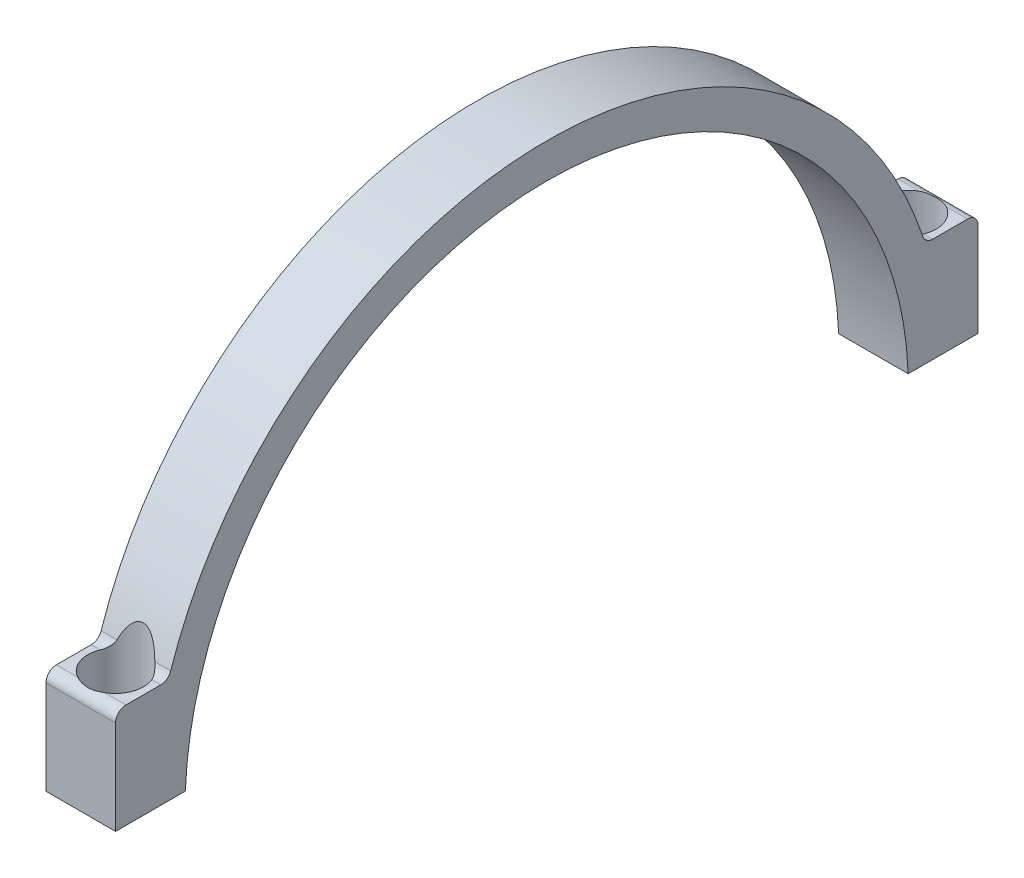
ISO-10303-21;
HEADER;
FILE_DESCRIPTION(('STEP AP214'),'2;1');
FILE_NAME('part.step','',(''),(''),'','','');
FILE_SCHEMA(('AUTOMOTIVE_DESIGN { 1 0 10303 214 1 1 1 1 }'));
ENDSEC;
DATA;
#1=APPLICATION_CONTEXT('core data for automotive mechanical design processes');
#2=APPLICATION_PROTOCOL_DEFINITION('international standard','automotive_design',2000,#1);
#3=PRODUCT_CONTEXT('',#1,'mechanical');
#4=PRODUCT('Part','Part','',(#3));
#5=PRODUCT_RELATED_PRODUCT_CATEGORY('part','',(#4));
#6=PRODUCT_DEFINITION_FORMATION('','',#4);
#7=PRODUCT_DEFINITION_CONTEXT('part definition',#1,'design');
#8=PRODUCT_DEFINITION('design','',#6,#7);
#9=PRODUCT_DEFINITION_SHAPE('','',#8);
#10=(LENGTH_UNIT() NAMED_UNIT(*) SI_UNIT(.MILLI.,.METRE.));
#11=(NAMED_UNIT(*) PLANE_ANGLE_UNIT() SI_UNIT($,.RADIAN.));
#12=(NAMED_UNIT(*) SI_UNIT($,.STERADIAN.) SOLID_ANGLE_UNIT());
#13=UNCERTAINTY_MEASURE_WITH_UNIT(LENGTH_MEASURE(1.E-05),#10,'distance_accuracy_value','');
#14=(GEOMETRIC_REPRESENTATION_CONTEXT(3) GLOBAL_UNCERTAINTY_ASSIGNED_CONTEXT((#13)) GLOBAL_UNIT_ASSIGNED_CONTEXT((#10,
#11,#12)) REPRESENTATION_CONTEXT('',''));
#15=CARTESIAN_POINT('',(0.,0.,0.));
#16=DIRECTION('',(0.,0.,1.));
#17=DIRECTION('',(1.,0.,0.));
#18=AXIS2_PLACEMENT_3D('',#15,#16,#17);
#19=CARTESIAN_POINT('',(10.,0.,0.));
#20=DIRECTION('',(-1.,0.,0.));
#21=DIRECTION('',(0.,0.,1.));
#22=AXIS2_PLACEMENT_3D('',#19,#20,#21);
#23=CYLINDRICAL_SURFACE('',#22,57.);
#24=CARTESIAN_POINT('',(8.04475811573962,16.9999999999999,54.4058820349418));
#25=CARTESIAN_POINT('',(8.02021668989877,17.0921756252909,54.3770804002913));
#26=CARTESIAN_POINT('',(7.99483062045849,17.1840716817121,54.34810867595));
#27=CARTESIAN_POINT('',(7.94221642335376,17.367247188698,54.2898513763058));
#28=CARTESIAN_POINT('',(7.91498807726504,17.4585265647317,54.2605657641353));
#29=CARTESIAN_POINT('',(7.83019634222226,17.7317172758495,54.1721595897697));
#30=CARTESIAN_POINT('',(7.76963197801326,17.9125785303137,54.1126155764916));
#31=CARTESIAN_POINT('',(7.63820795500454,18.2728715762059,53.9920245012619));
#32=CARTESIAN_POINT('',(7.56722818782228,18.4522566409079,53.9309679541037));
#33=CARTESIAN_POINT('',(7.41357596006679,18.8057769825377,53.8087133646927));
#34=CARTESIAN_POINT('',(7.33091515306761,18.9799172843484,53.7475155225443));
#35=CARTESIAN_POINT('',(7.19706963698908,19.2336862932719,53.6569955235999));
#36=CARTESIAN_POINT('',(7.15139505722209,19.3161230779365,53.6273706868382));
#37=CARTESIAN_POINT('',(7.05614950175837,19.4788701611248,53.5684711148856));
#38=CARTESIAN_POINT('',(7.00657809472277,19.5591802229231,53.5391964188661));
#39=CARTESIAN_POINT('',(6.90313383675338,19.7170697184556,53.4812511159975));
#40=CARTESIAN_POINT('',(6.8492664363487,19.7946524378573,53.4525798002264));
#41=CARTESIAN_POINT('',(6.73663764221897,19.9464887178001,53.3961061984532));
#42=CARTESIAN_POINT('',(6.67787735441499,20.0207430248444,53.3683037180148));
#43=CARTESIAN_POINT('',(6.52049337025103,20.2053444262742,53.2987656553869));
#44=CARTESIAN_POINT('',(6.41791281191497,20.312727405193,53.2579061635833));
#45=CARTESIAN_POINT('',(6.19686215845743,20.5119963084151,53.1814753360606));
#46=CARTESIAN_POINT('',(6.07843313528283,20.6039209486488,53.145890816334));
#47=CARTESIAN_POINT('',(5.8704262323805,20.7346868410194,53.0949695737657));
#48=CARTESIAN_POINT('',(5.78603761702789,20.780670869549,53.0769774306578));
#49=CARTESIAN_POINT('',(5.61058929920835,20.8599332980429,53.0458763030709));
#50=CARTESIAN_POINT('',(5.51953607027395,20.8932238373664,53.0327626533612));
#51=CARTESIAN_POINT('',(5.33132311713191,20.9442973303964,53.0126135930607));
#52=CARTESIAN_POINT('',(5.23410778311512,20.9619078194286,53.0056457881709));
#53=CARTESIAN_POINT('',(5.03785714681332,20.9787605186375,52.9989783530831));
#54=CARTESIAN_POINT('',(4.93882336955079,20.9780174755639,52.999272887719));
#55=CARTESIAN_POINT('',(4.75662826209187,20.9597091018676,53.006515164446));
#56=CARTESIAN_POINT('',(4.67317636485934,20.9444997378127,53.0125311099626));
#57=CARTESIAN_POINT('',(4.50991779796636,20.9020400252974,53.0292866312253));
#58=CARTESIAN_POINT('',(4.43011320614966,20.8747829053845,53.0400288633695));
#59=CARTESIAN_POINT('',(4.24249749912191,20.7964775897066,53.0707917419775));
#60=CARTESIAN_POINT('',(4.13719830021935,20.7402415042332,53.0928153987881));
#61=CARTESIAN_POINT('',(3.93740717669411,20.6130215646487,53.1423371332779));
#62=CARTESIAN_POINT('',(3.84293905914787,20.5420061536924,53.1698469196164));
#63=CARTESIAN_POINT('',(3.67763285456743,20.4010831696826,53.2240607048694));
#64=CARTESIAN_POINT('',(3.60537697645635,20.3326123100542,53.2502647423547));
#65=CARTESIAN_POINT('',(3.46740881553112,20.1899804187577,53.3045074574358));
#66=CARTESIAN_POINT('',(3.4017016709104,20.1158149986096,53.3325475474751));
#67=CARTESIAN_POINT('',(3.27568882768252,19.9626390417981,53.3900719955893));
#68=CARTESIAN_POINT('',(3.21542495301383,19.8835977469575,53.419565221091));
#69=CARTESIAN_POINT('',(3.10014467370146,19.7221520659507,53.4793804320906));
#70=CARTESIAN_POINT('',(3.04512637080013,19.6397489119004,53.5097021126389));
#71=CARTESIAN_POINT('',(2.92965543066536,19.4563060649596,53.5767058503067));
#72=CARTESIAN_POINT('',(2.87016245961617,19.3547051287168,53.6134997531534));
#73=CARTESIAN_POINT('',(2.75683035057199,19.1485248194427,53.6874847883641));
#74=CARTESIAN_POINT('',(2.70299304008703,19.043944497476,53.7246760448741));
#75=CARTESIAN_POINT('',(2.54866014946191,18.7262469292674,53.8365864126934));
#76=CARTESIAN_POINT('',(2.45558412721751,18.5095699676773,53.9114967747952));
#77=CARTESIAN_POINT('',(2.3293483772061,18.1844189165243,54.0216565262442));
#78=CARTESIAN_POINT('',(2.29020544515551,18.0782862898596,54.0572681438473));
#79=CARTESIAN_POINT('',(2.21513662541533,17.8647744862548,54.1282039956327));
#80=CARTESIAN_POINT('',(2.17921094999468,17.7573952275912,54.1635282107131));
#81=CARTESIAN_POINT('',(2.11044993260409,17.5421768622225,54.2336129444493));
#82=CARTESIAN_POINT('',(2.07759896336284,17.4343433621258,54.2683754761387));
#83=CARTESIAN_POINT('',(2.01452001873114,17.2178010280377,54.3374663978558));
#84=CARTESIAN_POINT('',(1.98429146432578,17.1090923930936,54.3717948822815));
#85=CARTESIAN_POINT('',(1.95524188426001,17.0000000000001,54.4058820349418));
#86=B_SPLINE_CURVE_WITH_KNOTS('',3,(#24,#25,#26,#27,#28,#29,#30,#31,#32,#33,#34,#35,#36,#37,#38,
#39,#40,#41,#42,#43,#44,#45,#46,#47,#48,#49,#50,#51,#52,#53,#54,#55,#56,#57,#58,#59,#60,#61,#62,
#63,#64,#65,#66,#67,#68,#69,#70,#71,#72,#73,#74,#75,#76,#77,#78,#79,#80,#81,#82,#83,#84,#85),
.UNSPECIFIED.,.F.,.F.,(4,2,2,2,2,2,2,2,2,2,2,2,2,2,2,2,2,2,2,2,2,2,2,2,2,2,2,2,2,2,4),(0.,
0.298911792083033,0.597859086101469,1.19705749584565,1.80380600160502,2.4099534038239,
2.70624581086818,3.00257106075351,3.29852615391512,3.59441453409029,4.05530592379549,
4.51502522508047,4.80740903489101,5.09951251925807,5.39479051544241,5.68983126852082,
5.9438039693589,6.19791959766482,6.56003426817362,6.92293020863465,7.23130123619968,
7.53991234047435,7.85072244355362,8.16141964092008,8.5312702029952,8.90123990940775,
9.6426326485812,9.99839039797047,10.354171602365,10.7080332913434,11.0618166496765),.UNSPECIFIED.);
#87=CARTESIAN_POINT('',(7.72814714192044,18.025641025641,54.0747285301991));
#88=VERTEX_POINT('',#87);
#89=CARTESIAN_POINT('',(2.27185285807955,18.025641025641,54.0747285301991));
#90=VERTEX_POINT('',#89);
#91=EDGE_CURVE('E173',#88,#90,#86,.T.);
#92=ORIENTED_EDGE('',*,*,#91,.F.);
#93=DIRECTION('',(-1.,0.,0.));
#94=VECTOR('',#93,1.);
#95=CARTESIAN_POINT('',(10.,18.025641025641,54.0747285301991));
#96=LINE('',#95,#94);
#97=CARTESIAN_POINT('',(10.,18.025641025641,54.0747285301991));
#98=VERTEX_POINT('',#97);
#99=EDGE_CURVE('E170',#98,#88,#96,.T.);
#100=ORIENTED_EDGE('',*,*,#99,.F.);
#101=CARTESIAN_POINT('',(10.,0.,0.));
#102=DIRECTION('',(1.,0.,0.));
#103=DIRECTION('',(0.,0.,-1.));
#104=AXIS2_PLACEMENT_3D('',#101,#102,#103);
#105=CIRCLE('',#104,57.);
#106=CARTESIAN_POINT('',(10.,18.025641025641,-54.0747285301991));
#107=VERTEX_POINT('',#106);
#108=EDGE_CURVE('E359',#107,#98,#105,.T.);
#109=ORIENTED_EDGE('',*,*,#108,.F.);
#110=DIRECTION('',(-1.,0.,0.));
#111=VECTOR('',#110,1.);
#112=CARTESIAN_POINT('',(10.,18.025641025641,-54.0747285301991));
#113=LINE('',#112,#111);
#114=CARTESIAN_POINT('',(7.72814714192045,18.025641025641,-54.0747285301991));
#115=VERTEX_POINT('',#114);
#116=EDGE_CURVE('E195',#107,#115,#113,.T.);
#117=ORIENTED_EDGE('',*,*,#116,.T.);
#118=CARTESIAN_POINT('',(1.9552418842604,17.,-54.4058820349418));
#119=CARTESIAN_POINT('',(1.97978331010125,17.092175625291,-54.3770804002913));
#120=CARTESIAN_POINT('',(2.00516937954153,17.1840716817122,-54.34810867595));
#121=CARTESIAN_POINT('',(2.05778357664626,17.367247188698,-54.2898513763057));
#122=CARTESIAN_POINT('',(2.08501192273498,17.4585265647318,-54.2605657641353));
#123=CARTESIAN_POINT('',(2.16980365777775,17.7317172758496,-54.1721595897697));
#124=CARTESIAN_POINT('',(2.23036802198675,17.9125785303137,-54.1126155764916));
#125=CARTESIAN_POINT('',(2.36179204499547,18.2728715762059,-53.9920245012619));
#126=CARTESIAN_POINT('',(2.43277181217773,18.4522566409079,-53.9309679541037));
#127=CARTESIAN_POINT('',(2.58642403993321,18.8057769825377,-53.8087133646927));
#128=CARTESIAN_POINT('',(2.66908484693238,18.9799172843484,-53.7475155225443));
#129=CARTESIAN_POINT('',(2.8029303630109,19.233686293272,-53.6569955235998));
#130=CARTESIAN_POINT('',(2.8486049427779,19.3161230779365,-53.6273706868382));
#131=CARTESIAN_POINT('',(2.94385049824162,19.4788701611249,-53.5684711148856));
#132=CARTESIAN_POINT('',(2.99342190527723,19.5591802229232,-53.5391964188661));
#133=CARTESIAN_POINT('',(3.09686616324661,19.7170697184556,-53.4812511159975));
#134=CARTESIAN_POINT('',(3.1507335636513,19.7946524378573,-53.4525798002264));
#135=CARTESIAN_POINT('',(3.26336235778104,19.9464887178001,-53.3961061984532));
#136=CARTESIAN_POINT('',(3.32212264558502,20.0207430248445,-53.3683037180148));
#137=CARTESIAN_POINT('',(3.47950662974898,20.2053444262743,-53.2987656553869));
#138=CARTESIAN_POINT('',(3.58208718808504,20.312727405193,-53.2579061635833));
#139=CARTESIAN_POINT('',(3.80313784154258,20.5119963084151,-53.1814753360606));
#140=CARTESIAN_POINT('',(3.92156686471717,20.6039209486488,-53.145890816334));
#141=CARTESIAN_POINT('',(4.12957376761949,20.7346868410194,-53.0949695737657));
#142=CARTESIAN_POINT('',(4.21396238297209,20.780670869549,-53.0769774306578));
#143=CARTESIAN_POINT('',(4.38941070079163,20.8599332980429,-53.0458763030709));
#144=CARTESIAN_POINT('',(4.48046392972604,20.8932238373665,-53.0327626533612));
#145=CARTESIAN_POINT('',(4.66867688286808,20.9442973303965,-53.0126135930607));
#146=CARTESIAN_POINT('',(4.76589221688486,20.9619078194287,-53.0056457881709));
#147=CARTESIAN_POINT('',(4.96214285318667,20.9787605186376,-52.9989783530831));
#148=CARTESIAN_POINT('',(5.0611766304492,20.978017475564,-52.999272887719));
#149=CARTESIAN_POINT('',(5.24337173790812,20.9597091018676,-53.006515164446));
#150=CARTESIAN_POINT('',(5.32682363514065,20.9444997378128,-53.0125311099626));
#151=CARTESIAN_POINT('',(5.49008220203363,20.9020400252974,-53.0292866312253));
#152=CARTESIAN_POINT('',(5.56988679385033,20.8747829053845,-53.0400288633695));
#153=CARTESIAN_POINT('',(5.75750250087808,20.7964775897066,-53.0707917419775));
#154=CARTESIAN_POINT('',(5.86280169978063,20.7402415042333,-53.0928153987881));
#155=CARTESIAN_POINT('',(6.06259282330588,20.6130215646488,-53.1423371332779));
#156=CARTESIAN_POINT('',(6.15706094085211,20.5420061536924,-53.1698469196164));
#157=CARTESIAN_POINT('',(6.32236714543255,20.4010831696826,-53.2240607048694));
#158=CARTESIAN_POINT('',(6.39462302354362,20.3326123100543,-53.2502647423546));
#159=CARTESIAN_POINT('',(6.53259118446885,20.1899804187578,-53.3045074574358));
#160=CARTESIAN_POINT('',(6.59829832908959,20.1158149986097,-53.3325475474751));
#161=CARTESIAN_POINT('',(6.72431117231748,19.9626390417982,-53.3900719955893));
#162=CARTESIAN_POINT('',(6.78457504698617,19.8835977469575,-53.419565221091));
#163=CARTESIAN_POINT('',(6.89985532629853,19.7221520659507,-53.4793804320906));
#164=CARTESIAN_POINT('',(6.95487362919985,19.6397489119005,-53.5097021126389));
#165=CARTESIAN_POINT('',(7.07034456933463,19.4563060649597,-53.5767058503067));
#166=CARTESIAN_POINT('',(7.12983754038382,19.3547051287169,-53.6134997531533));
#167=CARTESIAN_POINT('',(7.243169649428,19.1485248194428,-53.687484788364));
#168=CARTESIAN_POINT('',(7.29700695991295,19.0439444974761,-53.724676044874));
#169=CARTESIAN_POINT('',(7.45133985053808,18.7262469292675,-53.8365864126934));
#170=CARTESIAN_POINT('',(7.54441587278247,18.5095699676774,-53.9114967747952));
#171=CARTESIAN_POINT('',(7.67065162279388,18.1844189165244,-54.0216565262442));
#172=CARTESIAN_POINT('',(7.70979455484447,18.0782862898597,-54.0572681438473));
#173=CARTESIAN_POINT('',(7.78486337458465,17.8647744862549,-54.1282039956327));
#174=CARTESIAN_POINT('',(7.82078905000531,17.7573952275913,-54.1635282107131));
#175=CARTESIAN_POINT('',(7.88955006739589,17.5421768622226,-54.2336129444493));
#176=CARTESIAN_POINT('',(7.92240103663714,17.4343433621259,-54.2683754761386));
#177=CARTESIAN_POINT('',(7.98547998126884,17.2178010280378,-54.3374663978557));
#178=CARTESIAN_POINT('',(8.0157085356742,17.1090923930937,-54.3717948822815));
#179=CARTESIAN_POINT('',(8.04475811573996,17.0000000000002,-54.4058820349417));
#180=B_SPLINE_CURVE_WITH_KNOTS('',3,(#118,#119,#120,#121,#122,#123,#124,#125,#126,#127,#128,
#129,#130,#131,#132,#133,#134,#135,#136,#137,#138,#139,#140,#141,#142,#143,#144,#145,#146,#147,
#148,#149,#150,#151,#152,#153,#154,#155,#156,#157,#158,#159,#160,#161,#162,#163,#164,#165,#166,
#167,#168,#169,#170,#171,#172,#173,#174,#175,#176,#177,#178,#179),.UNSPECIFIED.,.F.,.F.,(4,2,2,
2,2,2,2,2,2,2,2,2,2,2,2,2,2,2,2,2,2,2,2,2,2,2,2,2,2,2,4),(0.,0.298911792083014,
0.597859086101441,1.1970574958456,1.80380600160495,2.40995340382382,2.70624581086811,
3.00257106075344,3.29852615391507,3.59441453409025,4.05530592379544,4.5150252250804,
4.80740903489094,5.099512519258,5.39479051544234,5.68983126852075,5.94380396935884,
6.19791959766475,6.56003426817355,6.92293020863458,7.23130123619961,7.53991234047428,
7.85072244355355,8.16141964092001,8.53127020299512,8.90123990940767,9.6426326485811,
9.99839039797037,10.3541716023649,10.7080332913433,11.0618166496764),.UNSPECIFIED.);
#181=CARTESIAN_POINT('',(2.27185285807955,18.025641025641,-54.0747285301991));
#182=VERTEX_POINT('',#181);
#183=EDGE_CURVE('E172',#182,#115,#180,.T.);
#184=ORIENTED_EDGE('',*,*,#183,.F.);
#185=CARTESIAN_POINT('',(0.,18.025641025641,-54.0747285301991));
#186=VERTEX_POINT('',#185);
#187=EDGE_CURVE('E194',#182,#186,#113,.T.);
#188=ORIENTED_EDGE('',*,*,#187,.T.);
#189=CARTESIAN_POINT('',(0.,0.,0.));
#190=DIRECTION('',(1.,0.,0.));
#191=DIRECTION('',(0.,0.,-1.));
#192=AXIS2_PLACEMENT_3D('',#189,#190,#191);
#193=CIRCLE('',#192,57.);
#194=CARTESIAN_POINT('',(0.,18.025641025641,54.0747285301991));
#195=VERTEX_POINT('',#194);
#196=EDGE_CURVE('E389',#186,#195,#193,.T.);
#197=ORIENTED_EDGE('',*,*,#196,.T.);
#198=EDGE_CURVE('E186',#90,#195,#96,.T.);
#199=ORIENTED_EDGE('',*,*,#198,.F.);
#200=EDGE_LOOP('',(#92,#100,#109,#117,#184,#188,#197,#199));
#201=FACE_BOUND('',#200,.T.);
#202=ADVANCED_FACE('F34',(#201),#23,.T.);
#203=CARTESIAN_POINT('',(10.,18.5,55.4977477020464));
#204=DIRECTION('',(-1.,0.,0.));
#205=DIRECTION('',(0.,0.,1.));
#206=AXIS2_PLACEMENT_3D('',#203,#204,#205);
#207=CYLINDRICAL_SURFACE('',#206,1.5);
#208=CARTESIAN_POINT('',(8.70718734801644,17.,55.4977477020464));
#209=CARTESIAN_POINT('',(8.68834071579113,17.0000003026064,55.4512243754451));
#210=CARTESIAN_POINT('',(8.66862253788781,17.0021645029546,55.4050972490219));
#211=CARTESIAN_POINT('',(8.62764041769816,17.0105984480433,55.3139658574587));
#212=CARTESIAN_POINT('',(8.60637791797873,17.0168644040475,55.2689605958523));
#213=CARTESIAN_POINT('',(8.54085449130837,17.041361360423,55.1366805974746));
#214=CARTESIAN_POINT('',(8.49456044834555,17.0652987229982,55.0514133701281));
#215=CARTESIAN_POINT('',(8.39859460019137,17.1265492258921,54.8884864602257));
#216=CARTESIAN_POINT('',(8.34893565146014,17.1638135508207,54.8108003137464));
#217=CARTESIAN_POINT('',(8.24778556385949,17.2505482904322,54.6633550909992));
#218=CARTESIAN_POINT('',(8.19628787675351,17.3000670496219,54.593629049546));
#219=CARTESIAN_POINT('',(8.08722165003763,17.4175589692785,54.4548437603026));
#220=CARTESIAN_POINT('',(8.02973049067319,17.487091475842,54.3870399961846));
#221=CARTESIAN_POINT('',(7.9198559261715,17.6400892133718,54.2648367741532));
#222=CARTESIAN_POINT('',(7.86744689529749,17.7234780943856,54.2103676997051));
#223=CARTESIAN_POINT('',(7.80346466111245,17.8472096416159,54.1467221560723));
#224=CARTESIAN_POINT('',(7.78697750103745,17.8815461539385,54.1306407455537));
#225=CARTESIAN_POINT('',(7.75596767299593,17.9521564513595,54.1008448197289));
#226=CARTESIAN_POINT('',(7.74144838381091,17.988433422927,54.0871343644291));
#227=CARTESIAN_POINT('',(7.72814714192045,18.025641025641,54.0747285301991));
#228=B_SPLINE_CURVE_WITH_KNOTS('',3,(#208,#209,#210,#211,#212,#213,#214,#215,#216,#217,#218,
#219,#220,#221,#222,#223,#224,#225,#226,#227),.UNSPECIFIED.,.F.,.F.,(4,2,2,2,2,2,2,2,2,4),(0.,
0.150462542490956,0.30078630050294,0.599106706731711,0.896345401083318,1.19477595522473,
1.53185024990347,1.86712533861797,1.99102465625406,2.1151340813116),.UNSPECIFIED.);
#229=CARTESIAN_POINT('',(8.70718734801644,16.9999999999999,55.4977477020464));
#230=VERTEX_POINT('',#229);
#231=EDGE_CURVE('E162',#230,#88,#228,.T.);
#232=ORIENTED_EDGE('',*,*,#231,.F.);
#233=DIRECTION('',(-1.,0.,0.));
#234=VECTOR('',#233,1.);
#235=CARTESIAN_POINT('',(10.,17.,55.4977477020464));
#236=LINE('',#235,#234);
#237=CARTESIAN_POINT('',(10.,17.,55.4977477020464));
#238=VERTEX_POINT('',#237);
#239=EDGE_CURVE('E167',#238,#230,#236,.T.);
#240=ORIENTED_EDGE('',*,*,#239,.F.);
#241=CARTESIAN_POINT('',(10.,18.5,55.4977477020464));
#242=DIRECTION('',(-1.,0.,0.));
#243=DIRECTION('',(0.,0.,-1.));
#244=AXIS2_PLACEMENT_3D('',#241,#242,#243);
#245=CIRCLE('',#244,1.5);
#246=EDGE_CURVE('E362',#98,#238,#245,.T.);
#247=ORIENTED_EDGE('',*,*,#246,.F.);
#248=ORIENTED_EDGE('',*,*,#99,.T.);
#249=EDGE_LOOP('',(#232,#240,#247,#248));
#250=FACE_BOUND('',#249,.T.);
#251=ADVANCED_FACE('F164',(#250),#207,.F.);
#252=CARTESIAN_POINT('',(2.27185285807955,18.025641025641,54.0747285301991));
#253=CARTESIAN_POINT('',(2.25676457783934,17.9834495362518,54.0887985047432));
#254=CARTESIAN_POINT('',(2.24011906612223,17.9424556975783,54.1045420692986));
#255=CARTESIAN_POINT('',(2.20437312620557,17.862981677779,54.139041247541));
#256=CARTESIAN_POINT('',(2.18527773067037,17.824496580925,54.1577907055604));
#257=CARTESIAN_POINT('',(2.12550627748145,17.7133038113988,54.217835177029));
#258=CARTESIAN_POINT('',(2.08209489158177,17.6442126010821,54.2631510412224));
#259=CARTESIAN_POINT('',(1.99203412013165,17.5163173598332,54.3624603375538));
#260=CARTESIAN_POINT('',(1.94541289115349,17.4574366838787,54.4163827070339));
#261=CARTESIAN_POINT('',(1.85088881310071,17.3491098592873,54.5324661826566));
#262=CARTESIAN_POINT('',(1.80298212987949,17.2996966276922,54.5946548043923));
#263=CARTESIAN_POINT('',(1.69765829104198,17.2014373615263,54.7407303954283));
#264=CARTESIAN_POINT('',(1.64042336223879,17.1550219185583,54.8264021090894));
#265=CARTESIAN_POINT('',(1.53016359805717,17.0791264002039,55.0071704169324));
#266=CARTESIAN_POINT('',(1.47712578886833,17.0495922276559,55.1022357468153));
#267=CARTESIAN_POINT('',(1.40327262025773,17.0199786385794,55.2488683010509));
#268=CARTESIAN_POINT('',(1.37988346360681,17.0125613503957,55.2977356716693));
#269=CARTESIAN_POINT('',(1.33492127369737,17.0025704431766,55.3968248716335));
#270=CARTESIAN_POINT('',(1.31334965470051,17.0000005633522,55.447047716306));
#271=CARTESIAN_POINT('',(1.29281265198356,17.,55.4977477020464));
#272=B_SPLINE_CURVE_WITH_KNOTS('',3,(#252,#253,#254,#255,#256,#257,#258,#259,#260,#261,#262,
#263,#264,#265,#266,#267,#268,#269,#270,#271),.UNSPECIFIED.,.F.,.F.,(4,2,2,2,2,2,2,2,2,4),(0.,
0.140708914443435,0.281133272600869,0.559830019823909,0.836334507666277,1.11378358022282,
1.4511952368156,1.78751948413424,1.95133345614448,2.11527373996493),.UNSPECIFIED.);
#273=CARTESIAN_POINT('',(1.29281265198355,16.9999999999999,55.4977477020464));
#274=VERTEX_POINT('',#273);
#275=EDGE_CURVE('E277',#90,#274,#272,.T.);
#276=ORIENTED_EDGE('',*,*,#275,.F.);
#277=ORIENTED_EDGE('',*,*,#198,.T.);
#278=CARTESIAN_POINT('',(0.,18.5,55.4977477020464));
#279=DIRECTION('',(-1.,0.,0.));
#280=DIRECTION('',(0.,0.,-1.));
#281=AXIS2_PLACEMENT_3D('',#278,#279,#280);
#282=CIRCLE('',#281,1.5);
#283=CARTESIAN_POINT('',(0.,17.,55.4977477020464));
#284=VERTEX_POINT('',#283);
#285=EDGE_CURVE('E392',#195,#284,#282,.T.);
#286=ORIENTED_EDGE('',*,*,#285,.T.);
#287=EDGE_CURVE('E187',#274,#284,#236,.T.);
#288=ORIENTED_EDGE('',*,*,#287,.F.);
#289=EDGE_LOOP('',(#276,#277,#286,#288));
#290=FACE_BOUND('',#289,.T.);
#291=ADVANCED_FACE('F272',(#290),#207,.F.);
#292=CARTESIAN_POINT('',(10.,18.5,-55.4977477020464));
#293=DIRECTION('',(-1.,0.,0.));
#294=DIRECTION('',(0.,0.,1.));
#295=AXIS2_PLACEMENT_3D('',#292,#293,#294);
#296=CYLINDRICAL_SURFACE('',#295,1.5);
#297=CARTESIAN_POINT('',(7.72814714192045,18.025641025641,-54.0747285301991));
#298=CARTESIAN_POINT('',(7.74323542216066,17.9834495362517,-54.0887985047432));
#299=CARTESIAN_POINT('',(7.75988093387777,17.9424556975783,-54.1045420692986));
#300=CARTESIAN_POINT('',(7.79562687379442,17.8629816777789,-54.139041247541));
#301=CARTESIAN_POINT('',(7.81472226932963,17.824496580925,-54.1577907055604));
#302=CARTESIAN_POINT('',(7.87449372251855,17.7133038113987,-54.217835177029));
#303=CARTESIAN_POINT('',(7.91790510841823,17.6442126010821,-54.2631510412224));
#304=CARTESIAN_POINT('',(8.00796587986835,17.5163173598331,-54.3624603375538));
#305=CARTESIAN_POINT('',(8.05458710884652,17.4574366838787,-54.4163827070339));
#306=CARTESIAN_POINT('',(8.1491111868993,17.3491098592873,-54.5324661826566));
#307=CARTESIAN_POINT('',(8.19701787012051,17.2996966276921,-54.5946548043923));
#308=CARTESIAN_POINT('',(8.30234170895802,17.2014373615263,-54.7407303954283));
#309=CARTESIAN_POINT('',(8.35957663776121,17.1550219185583,-54.8264021090894));
#310=CARTESIAN_POINT('',(8.46983640194283,17.0791264002039,-55.0071704169324));
#311=CARTESIAN_POINT('',(8.52287421113168,17.0495922276559,-55.1022357468153));
#312=CARTESIAN_POINT('',(8.59672737974228,17.0199786385794,-55.2488683010509));
#313=CARTESIAN_POINT('',(8.62011653639319,17.0125613503957,-55.2977356716693));
#314=CARTESIAN_POINT('',(8.66507872630263,17.0025704431766,-55.3968248716335));
#315=CARTESIAN_POINT('',(8.68665034529948,17.0000005633522,-55.4470477163059));
#316=CARTESIAN_POINT('',(8.70718734801644,17.,-55.4977477020464));
#317=B_SPLINE_CURVE_WITH_KNOTS('',3,(#297,#298,#299,#300,#301,#302,#303,#304,#305,#306,#307,
#308,#309,#310,#311,#312,#313,#314,#315,#316),.UNSPECIFIED.,.F.,.F.,(4,2,2,2,2,2,2,2,2,4),(0.,
0.140708914443439,0.28113327260087,0.559830019823917,0.836334507666287,1.11378358022283,
1.45119523681562,1.78751948413426,1.95133345614448,2.11527373996493),.UNSPECIFIED.);
#318=CARTESIAN_POINT('',(8.70718734801645,17.,-55.4977477020464));
#319=VERTEX_POINT('',#318);
#320=EDGE_CURVE('E309',#115,#319,#317,.T.);
#321=ORIENTED_EDGE('',*,*,#320,.F.);
#322=ORIENTED_EDGE('',*,*,#116,.F.);
#323=CARTESIAN_POINT('',(10.,18.5,-55.4977477020464));
#324=DIRECTION('',(-1.,0.,0.));
#325=DIRECTION('',(0.,0.,1.));
#326=AXIS2_PLACEMENT_3D('',#323,#324,#325);
#327=CIRCLE('',#326,1.5);
#328=CARTESIAN_POINT('',(10.,17.,-55.4977477020464));
#329=VERTEX_POINT('',#328);
#330=EDGE_CURVE('E357',#329,#107,#327,.T.);
#331=ORIENTED_EDGE('',*,*,#330,.F.);
#332=DIRECTION('',(-1.,0.,0.));
#333=VECTOR('',#332,1.);
#334=CARTESIAN_POINT('',(10.,17.,-55.4977477020464));
#335=LINE('',#334,#333);
#336=EDGE_CURVE('E199',#329,#319,#335,.T.);
#337=ORIENTED_EDGE('',*,*,#336,.T.);
#338=EDGE_LOOP('',(#321,#322,#331,#337));
#339=FACE_BOUND('',#338,.T.);
#340=ADVANCED_FACE('F314',(#339),#296,.F.);
#341=CARTESIAN_POINT('',(1.29281265198356,17.,-55.4977477020464));
#342=CARTESIAN_POINT('',(1.31165928420888,17.0000003026063,-55.4512243754451));
#343=CARTESIAN_POINT('',(1.33137746211219,17.0021645029546,-55.4050972490219));
#344=CARTESIAN_POINT('',(1.37235958230184,17.0105984480433,-55.3139658574587));
#345=CARTESIAN_POINT('',(1.39362208202128,17.0168644040475,-55.2689605958523));
#346=CARTESIAN_POINT('',(1.45914550869163,17.041361360423,-55.1366805974746));
#347=CARTESIAN_POINT('',(1.50543955165445,17.0652987229981,-55.0514133701281));
#348=CARTESIAN_POINT('',(1.60140539980863,17.1265492258921,-54.8884864602257));
#349=CARTESIAN_POINT('',(1.65106434853987,17.1638135508207,-54.8108003137464));
#350=CARTESIAN_POINT('',(1.75221443614052,17.2505482904322,-54.6633550909992));
#351=CARTESIAN_POINT('',(1.8037121232465,17.3000670496219,-54.5936290495459));
#352=CARTESIAN_POINT('',(1.91277834996238,17.4175589692785,-54.4548437603026));
#353=CARTESIAN_POINT('',(1.97026950932682,17.487091475842,-54.3870399961846));
#354=CARTESIAN_POINT('',(2.08014407382851,17.6400892133718,-54.2648367741532));
#355=CARTESIAN_POINT('',(2.13255310470252,17.7234780943856,-54.2103676997051));
#356=CARTESIAN_POINT('',(2.19653533888756,17.8472096416159,-54.1467221560723));
#357=CARTESIAN_POINT('',(2.21302249896256,17.8815461539385,-54.1306407455537));
#358=CARTESIAN_POINT('',(2.24403232700407,17.9521564513595,-54.1008448197289));
#359=CARTESIAN_POINT('',(2.2585516161891,17.988433422927,-54.0871343644291));
#360=CARTESIAN_POINT('',(2.27185285807955,18.025641025641,-54.0747285301991));
#361=B_SPLINE_CURVE_WITH_KNOTS('',3,(#341,#342,#343,#344,#345,#346,#347,#348,#349,#350,#351,
#352,#353,#354,#355,#356,#357,#358,#359,#360),.UNSPECIFIED.,.F.,.F.,(4,2,2,2,2,2,2,2,2,4),(0.,
0.150462542490956,0.30078630050294,0.599106706731712,0.896345401083318,1.19477595522473,
1.53185024990347,1.86712533861798,1.99102465625407,2.1151340813116),.UNSPECIFIED.);
#362=CARTESIAN_POINT('',(1.29281265198356,17.,-55.4977477020464));
#363=VERTEX_POINT('',#362);
#364=EDGE_CURVE('E305',#363,#182,#361,.T.);
#365=ORIENTED_EDGE('',*,*,#364,.F.);
#366=CARTESIAN_POINT('',(0.,17.,-55.4977477020464));
#367=VERTEX_POINT('',#366);
#368=EDGE_CURVE('E198',#363,#367,#335,.T.);
#369=ORIENTED_EDGE('',*,*,#368,.T.);
#370=CARTESIAN_POINT('',(0.,18.5,-55.4977477020464));
#371=DIRECTION('',(-1.,0.,0.));
#372=DIRECTION('',(0.,0.,1.));
#373=AXIS2_PLACEMENT_3D('',#370,#371,#372);
#374=CIRCLE('',#373,1.5);
#375=EDGE_CURVE('E386',#367,#186,#374,.T.);
#376=ORIENTED_EDGE('',*,*,#375,.T.);
#377=ORIENTED_EDGE('',*,*,#187,.F.);
#378=EDGE_LOOP('',(#365,#369,#376,#377));
#379=FACE_BOUND('',#378,.T.);
#380=ADVANCED_FACE('F318',(#379),#296,.F.);
#381=CARTESIAN_POINT('',(10.,17.,-60.5));
#382=DIRECTION('',(0.,-1.,0.));
#383=DIRECTION('',(0.,0.,-1.));
#384=AXIS2_PLACEMENT_3D('',#381,#382,#383);
#385=PLANE('',#384);
#386=CARTESIAN_POINT('',(5.,17.,-57.));
#387=DIRECTION('',(0.,1.,0.));
#388=DIRECTION('',(0.,0.,1.));
#389=AXIS2_PLACEMENT_3D('',#386,#387,#388);
#390=CIRCLE('',#389,4.);
#391=CARTESIAN_POINT('',(6.93649167310373,17.,-60.5));
#392=VERTEX_POINT('',#391);
#393=EDGE_CURVE('E52',#319,#392,#390,.T.);
#394=ORIENTED_EDGE('',*,*,#393,.F.);
#395=ORIENTED_EDGE('',*,*,#336,.F.);
#396=DIRECTION('',(0.,0.,1.));
#397=VECTOR('',#396,1.);
#398=CARTESIAN_POINT('',(10.,17.,-60.5));
#399=LINE('',#398,#397);
#400=CARTESIAN_POINT('',(10.,17.,-60.5));
#401=VERTEX_POINT('',#400);
#402=EDGE_CURVE('E360',#401,#329,#399,.T.);
#403=ORIENTED_EDGE('',*,*,#402,.F.);
#404=DIRECTION('',(-1.,0.,0.));
#405=VECTOR('',#404,1.);
#406=CARTESIAN_POINT('',(10.,17.,-60.5));
#407=LINE('',#406,#405);
#408=EDGE_CURVE('E203',#401,#392,#407,.T.);
#409=ORIENTED_EDGE('',*,*,#408,.T.);
#410=EDGE_LOOP('',(#394,#395,#403,#409));
#411=FACE_BOUND('',#410,.T.);
#412=ADVANCED_FACE('F320',(#411),#385,.F.);
#413=CARTESIAN_POINT('',(3.06350832689629,17.,-60.5));
#414=VERTEX_POINT('',#413);
#415=EDGE_CURVE('E346',#414,#363,#390,.T.);
#416=ORIENTED_EDGE('',*,*,#415,.F.);
#417=CARTESIAN_POINT('',(0.,17.,-60.5));
#418=VERTEX_POINT('',#417);
#419=EDGE_CURVE('E202',#414,#418,#407,.T.);
#420=ORIENTED_EDGE('',*,*,#419,.T.);
#421=DIRECTION('',(0.,0.,1.));
#422=VECTOR('',#421,1.);
#423=CARTESIAN_POINT('',(0.,17.,-60.5));
#424=LINE('',#423,#422);
#425=EDGE_CURVE('E383',#418,#367,#424,.T.);
#426=ORIENTED_EDGE('',*,*,#425,.T.);
#427=ORIENTED_EDGE('',*,*,#368,.F.);
#428=EDGE_LOOP('',(#416,#420,#426,#427));
#429=FACE_BOUND('',#428,.T.);
#430=ADVANCED_FACE('F324',(#429),#385,.F.);
#431=CARTESIAN_POINT('',(10.,17.,60.5));
#432=DIRECTION('',(0.,-1.,0.));
#433=DIRECTION('',(0.,0.,-1.));
#434=AXIS2_PLACEMENT_3D('',#431,#432,#433);
#435=PLANE('',#434);
#436=ORIENTED_EDGE('',*,*,#239,.T.);
#437=CARTESIAN_POINT('',(5.,16.9999999999999,57.));
#438=DIRECTION('',(0.,1.,0.));
#439=DIRECTION('',(0.,0.,1.));
#440=AXIS2_PLACEMENT_3D('',#437,#438,#439);
#441=CIRCLE('',#440,4.);
#442=CARTESIAN_POINT('',(6.93649167310373,16.9999999999999,60.5));
#443=VERTEX_POINT('',#442);
#444=EDGE_CURVE('E176',#443,#230,#441,.T.);
#445=ORIENTED_EDGE('',*,*,#444,.F.);
#446=DIRECTION('',(-1.,0.,0.));
#447=VECTOR('',#446,1.);
#448=CARTESIAN_POINT('',(10.,17.,60.5));
#449=LINE('',#448,#447);
#450=CARTESIAN_POINT('',(10.,17.,60.5));
#451=VERTEX_POINT('',#450);
#452=EDGE_CURVE('E190',#451,#443,#449,.T.);
#453=ORIENTED_EDGE('',*,*,#452,.F.);
#454=DIRECTION('',(0.,0.,1.));
#455=VECTOR('',#454,1.);
#456=CARTESIAN_POINT('',(10.,17.,60.5));
#457=LINE('',#456,#455);
#458=EDGE_CURVE('E185',#238,#451,#457,.T.);
#459=ORIENTED_EDGE('',*,*,#458,.F.);
#460=EDGE_LOOP('',(#436,#445,#453,#459));
#461=FACE_BOUND('',#460,.T.);
#462=ADVANCED_FACE('F184',(#461),#435,.F.);
#463=CARTESIAN_POINT('',(10.,15.5,60.5));
#464=DIRECTION('',(-1.,0.,0.));
#465=DIRECTION('',(0.,0.,1.));
#466=AXIS2_PLACEMENT_3D('',#463,#464,#465);
#467=CYLINDRICAL_SURFACE('',#466,1.5);
#468=ORIENTED_EDGE('',*,*,#452,.T.);
#469=CARTESIAN_POINT('',(6.93649167310374,17.,60.5));
#470=CARTESIAN_POINT('',(6.88998369312539,16.9999972392637,60.525732483187));
#471=CARTESIAN_POINT('',(6.84297271261463,16.9993382103212,60.5505315935183));
#472=CARTESIAN_POINT('',(6.74802987069456,16.9969715032363,60.5982235741238));
#473=CARTESIAN_POINT('',(6.70009818926215,16.9952640280616,60.62111681238));
#474=CARTESIAN_POINT('',(6.55509108669644,16.9889671338863,60.686861770137));
#475=CARTESIAN_POINT('',(6.45673735859048,16.9832024927689,60.7268153641471));
#476=CARTESIAN_POINT('',(6.25720454635008,16.9703977069438,60.7987755990926));
#477=CARTESIAN_POINT('',(6.15602387609275,16.9633568335057,60.8307776748195));
#478=CARTESIAN_POINT('',(5.95140161964154,16.9495954879763,60.8866543967816));
#479=CARTESIAN_POINT('',(5.84795972659949,16.9428750597681,60.910527932595));
#480=CARTESIAN_POINT('',(5.6356610593275,16.9308489113242,60.950698675735));
#481=CARTESIAN_POINT('',(5.52674325041086,16.9256026805859,60.9666929279299));
#482=CARTESIAN_POINT('',(5.30786267064773,16.9178816921376,60.9896525243972));
#483=CARTESIAN_POINT('',(5.19789995973388,16.915406776429,60.9966183834015));
#484=CARTESIAN_POINT('',(4.97779244832953,16.913701779224,61.0014521451694));
#485=CARTESIAN_POINT('',(4.8676477395439,16.9144703849094,60.9993237288451));
#486=CARTESIAN_POINT('',(4.64797979002594,16.9191030850525,60.985999264615));
#487=CARTESIAN_POINT('',(4.53845653687625,16.9229671174393,60.9748033985339));
#488=CARTESIAN_POINT('',(4.32332958160639,16.9329294769238,60.9438123556525));
#489=CARTESIAN_POINT('',(4.21769373193931,16.9389742332138,60.924221406893));
#490=CARTESIAN_POINT('',(4.00838322477556,16.9521580389644,60.876624511146));
#491=CARTESIAN_POINT('',(3.90470900397615,16.9592973289434,60.8486167132955));
#492=CARTESIAN_POINT('',(3.70012230359708,16.9731540982108,60.7844145956685));
#493=CARTESIAN_POINT('',(3.59920488140853,16.9798723647713,60.7482361753744));
#494=CARTESIAN_POINT('',(3.4005390088889,16.9911316820535,60.6678587065447));
#495=CARTESIAN_POINT('',(3.30278837375155,16.9956742649746,60.6236653327727));
#496=CARTESIAN_POINT('',(3.15863288127683,16.9993128185662,60.5513796104659));
#497=CARTESIAN_POINT('',(3.11080518476885,16.9999926875464,60.5261712697439));
#498=CARTESIAN_POINT('',(3.06350832689626,17.,60.5));
#499=B_SPLINE_CURVE_WITH_KNOTS('',3,(#469,#470,#471,#472,#473,#474,#475,#476,#477,#478,#479,
#480,#481,#482,#483,#484,#485,#486,#487,#488,#489,#490,#491,#492,#493,#494,#495,#496,#497,#498),
.UNSPECIFIED.,.F.,.F.,(4,2,2,2,2,2,2,2,2,2,2,2,2,2,4),(0.,0.15942194430245,0.318813036002237,
0.637368872114413,0.956107180393197,1.27488901334594,1.60512185578126,1.93533586996989,
2.26541624254662,2.59548999636191,2.91795317705095,3.24048731926564,3.56239915844981,
3.88408396048942,4.04623816143593),.UNSPECIFIED.);
#500=CARTESIAN_POINT('',(3.06350832689626,17.,60.5));
#501=VERTEX_POINT('',#500);
#502=EDGE_CURVE('E178',#443,#501,#499,.T.);
#503=ORIENTED_EDGE('',*,*,#502,.T.);
#504=CARTESIAN_POINT('',(0.,17.,60.5));
#505=VERTEX_POINT('',#504);
#506=EDGE_CURVE('E369',#501,#505,#449,.T.);
#507=ORIENTED_EDGE('',*,*,#506,.T.);
#508=CARTESIAN_POINT('',(0.,15.5,60.5));
#509=DIRECTION('',(1.,0.,0.));
#510=DIRECTION('',(0.,0.,1.));
#511=AXIS2_PLACEMENT_3D('',#508,#509,#510);
#512=CIRCLE('',#511,1.5);
#513=CARTESIAN_POINT('',(0.,15.5,62.));
#514=VERTEX_POINT('',#513);
#515=EDGE_CURVE('E221',#505,#514,#512,.T.);
#516=ORIENTED_EDGE('',*,*,#515,.T.);
#517=DIRECTION('',(-1.,0.,0.));
#518=VECTOR('',#517,1.);
#519=CARTESIAN_POINT('',(10.,15.5,62.));
#520=LINE('',#519,#518);
#521=CARTESIAN_POINT('',(10.,15.5,62.));
#522=VERTEX_POINT('',#521);
#523=EDGE_CURVE('E11',#522,#514,#520,.T.);
#524=ORIENTED_EDGE('',*,*,#523,.F.);
#525=CARTESIAN_POINT('',(10.,15.5,60.5));
#526=DIRECTION('',(1.,0.,0.));
#527=DIRECTION('',(0.,0.,1.));
#528=AXIS2_PLACEMENT_3D('',#525,#526,#527);
#529=CIRCLE('',#528,1.5);
#530=EDGE_CURVE('E239',#451,#522,#529,.T.);
#531=ORIENTED_EDGE('',*,*,#530,.F.);
#532=EDGE_LOOP('',(#468,#503,#507,#516,#524,#531));
#533=FACE_BOUND('',#532,.T.);
#534=ADVANCED_FACE('F36',(#533),#467,.T.);
#535=CARTESIAN_POINT('',(10.,2.,62.));
#536=DIRECTION('',(0.,0.,-1.));
#537=DIRECTION('',(-1.,0.,0.));
#538=AXIS2_PLACEMENT_3D('',#535,#536,#537);
#539=PLANE('',#538);
#540=DIRECTION('',(0.,-1.,0.));
#541=VECTOR('',#540,1.);
#542=CARTESIAN_POINT('',(0.,2.,62.));
#543=LINE('',#542,#541);
#544=CARTESIAN_POINT('',(0.,2.,62.));
#545=VERTEX_POINT('',#544);
#546=EDGE_CURVE('E225',#514,#545,#543,.T.);
#547=ORIENTED_EDGE('',*,*,#546,.T.);
#548=DIRECTION('',(-1.,0.,0.));
#549=VECTOR('',#548,1.);
#550=CARTESIAN_POINT('',(10.,2.,62.));
#551=LINE('',#550,#549);
#552=CARTESIAN_POINT('',(10.,2.,62.));
#553=VERTEX_POINT('',#552);
#554=EDGE_CURVE('E44',#553,#545,#551,.T.);
#555=ORIENTED_EDGE('',*,*,#554,.F.);
#556=DIRECTION('',(0.,-1.,0.));
#557=VECTOR('',#556,1.);
#558=CARTESIAN_POINT('',(10.,2.,62.));
#559=LINE('',#558,#557);
#560=EDGE_CURVE('E399',#522,#553,#559,.T.);
#561=ORIENTED_EDGE('',*,*,#560,.F.);
#562=ORIENTED_EDGE('',*,*,#523,.T.);
#563=EDGE_LOOP('',(#547,#555,#561,#562));
#564=FACE_BOUND('',#563,.T.);
#565=ADVANCED_FACE('F423',(#564),#539,.F.);
#566=CARTESIAN_POINT('',(10.,2.,62.));
#567=DIRECTION('',(0.,1.,0.));
#568=DIRECTION('',(0.,0.,1.));
#569=AXIS2_PLACEMENT_3D('',#566,#567,#568);
#570=PLANE('',#569);
#571=CARTESIAN_POINT('',(5.,2.,57.));
#572=DIRECTION('',(0.,1.,0.));
#573=DIRECTION('',(0.,0.,1.));
#574=AXIS2_PLACEMENT_3D('',#571,#572,#573);
#575=CIRCLE('',#574,2.15);
#576=CARTESIAN_POINT('',(5.,2.,59.15));
#577=VERTEX_POINT('',#576);
#578=EDGE_CURVE('E219',#577,#577,#575,.T.);
#579=ORIENTED_EDGE('',*,*,#578,.T.);
#580=EDGE_LOOP('',(#579));
#581=FACE_BOUND('',#580,.T.);
#582=DIRECTION('',(0.,0.,-1.));
#583=VECTOR('',#582,1.);
#584=CARTESIAN_POINT('',(0.,2.,62.));
#585=LINE('',#584,#583);
#586=CARTESIAN_POINT('',(0.,2.,51.9615242270663));
#587=VERTEX_POINT('',#586);
#588=EDGE_CURVE('E372',#545,#587,#585,.T.);
#589=ORIENTED_EDGE('',*,*,#588,.T.);
#590=DIRECTION('',(-1.,0.,0.));
#591=VECTOR('',#590,1.);
#592=CARTESIAN_POINT('',(10.,2.,51.9615242270663));
#593=LINE('',#592,#591);
#594=CARTESIAN_POINT('',(10.,2.,51.9615242270663));
#595=VERTEX_POINT('',#594);
#596=EDGE_CURVE('E215',#595,#587,#593,.T.);
#597=ORIENTED_EDGE('',*,*,#596,.F.);
#598=DIRECTION('',(0.,0.,-1.));
#599=VECTOR('',#598,1.);
#600=CARTESIAN_POINT('',(10.,2.,62.));
#601=LINE('',#600,#599);
#602=EDGE_CURVE('E402',#553,#595,#601,.T.);
#603=ORIENTED_EDGE('',*,*,#602,.F.);
#604=ORIENTED_EDGE('',*,*,#554,.T.);
#605=EDGE_LOOP('',(#589,#597,#603,#604));
#606=FACE_BOUND('',#605,.T.);
#607=ADVANCED_FACE('F428',(#581,#606),#570,.F.);
#608=CARTESIAN_POINT('',(10.,0.,0.));
#609=DIRECTION('',(-1.,0.,0.));
#610=DIRECTION('',(0.,0.,1.));
#611=AXIS2_PLACEMENT_3D('',#608,#609,#610);
#612=CYLINDRICAL_SURFACE('',#611,52.);
#613=CARTESIAN_POINT('',(0.,0.,0.));
#614=DIRECTION('',(-1.,0.,0.));
#615=DIRECTION('',(0.,0.,-1.));
#616=AXIS2_PLACEMENT_3D('',#613,#614,#615);
#617=CIRCLE('',#616,52.);
#618=CARTESIAN_POINT('',(0.,2.,-51.9615242270663));
#619=VERTEX_POINT('',#618);
#620=EDGE_CURVE('E374',#587,#619,#617,.T.);
#621=ORIENTED_EDGE('',*,*,#620,.T.);
#622=DIRECTION('',(-1.,0.,0.));
#623=VECTOR('',#622,1.);
#624=CARTESIAN_POINT('',(10.,2.,-51.9615242270663));
#625=LINE('',#624,#623);
#626=CARTESIAN_POINT('',(10.,2.,-51.9615242270663));
#627=VERTEX_POINT('',#626);
#628=EDGE_CURVE('E212',#627,#619,#625,.T.);
#629=ORIENTED_EDGE('',*,*,#628,.F.);
#630=CARTESIAN_POINT('',(10.,0.,0.));
#631=DIRECTION('',(-1.,0.,0.));
#632=DIRECTION('',(0.,0.,-1.));
#633=AXIS2_PLACEMENT_3D('',#630,#631,#632);
#634=CIRCLE('',#633,52.);
#635=EDGE_CURVE('E404',#595,#627,#634,.T.);
#636=ORIENTED_EDGE('',*,*,#635,.F.);
#637=ORIENTED_EDGE('',*,*,#596,.T.);
#638=EDGE_LOOP('',(#621,#629,#636,#637));
#639=FACE_BOUND('',#638,.T.);
#640=ADVANCED_FACE('F434',(#639),#612,.F.);
#641=CARTESIAN_POINT('',(10.,2.,-51.9615242270663));
#642=DIRECTION('',(0.,1.,0.));
#643=DIRECTION('',(0.,0.,1.));
#644=AXIS2_PLACEMENT_3D('',#641,#642,#643);
#645=PLANE('',#644);
#646=CARTESIAN_POINT('',(5.,2.,-57.));
#647=DIRECTION('',(0.,1.,0.));
#648=DIRECTION('',(0.,0.,1.));
#649=AXIS2_PLACEMENT_3D('',#646,#647,#648);
#650=CIRCLE('',#649,2.15);
#651=CARTESIAN_POINT('',(5.,2.,-54.85));
#652=VERTEX_POINT('',#651);
#653=EDGE_CURVE('E39',#652,#652,#650,.T.);
#654=ORIENTED_EDGE('',*,*,#653,.T.);
#655=EDGE_LOOP('',(#654));
#656=FACE_BOUND('',#655,.T.);
#657=DIRECTION('',(0.,0.,-1.));
#658=VECTOR('',#657,1.);
#659=CARTESIAN_POINT('',(0.,2.,-51.9615242270663));
#660=LINE('',#659,#658);
#661=CARTESIAN_POINT('',(0.,2.,-62.));
#662=VERTEX_POINT('',#661);
#663=EDGE_CURVE('E376',#619,#662,#660,.T.);
#664=ORIENTED_EDGE('',*,*,#663,.T.);
#665=DIRECTION('',(-1.,0.,0.));
#666=VECTOR('',#665,1.);
#667=CARTESIAN_POINT('',(10.,2.,-62.));
#668=LINE('',#667,#666);
#669=CARTESIAN_POINT('',(10.,2.,-62.));
#670=VERTEX_POINT('',#669);
#671=EDGE_CURVE('E209',#670,#662,#668,.T.);
#672=ORIENTED_EDGE('',*,*,#671,.F.);
#673=DIRECTION('',(0.,0.,-1.));
#674=VECTOR('',#673,1.);
#675=CARTESIAN_POINT('',(10.,2.,-51.9615242270663));
#676=LINE('',#675,#674);
#677=EDGE_CURVE('E408',#627,#670,#676,.T.);
#678=ORIENTED_EDGE('',*,*,#677,.F.);
#679=ORIENTED_EDGE('',*,*,#628,.T.);
#680=EDGE_LOOP('',(#664,#672,#678,#679));
#681=FACE_BOUND('',#680,.T.);
#682=ADVANCED_FACE('F438',(#656,#681),#645,.F.);
#683=CARTESIAN_POINT('',(10.,2.,-62.));
#684=DIRECTION('',(0.,0.,1.));
#685=DIRECTION('',(1.,0.,0.));
#686=AXIS2_PLACEMENT_3D('',#683,#684,#685);
#687=PLANE('',#686);
#688=DIRECTION('',(0.,1.,0.));
#689=VECTOR('',#688,1.);
#690=CARTESIAN_POINT('',(0.,2.,-62.));
#691=LINE('',#690,#689);
#692=CARTESIAN_POINT('',(0.,15.5,-62.));
#693=VERTEX_POINT('',#692);
#694=EDGE_CURVE('E378',#662,#693,#691,.T.);
#695=ORIENTED_EDGE('',*,*,#694,.T.);
#696=DIRECTION('',(-1.,0.,0.));
#697=VECTOR('',#696,1.);
#698=CARTESIAN_POINT('',(10.,15.5,-62.));
#699=LINE('',#698,#697);
#700=CARTESIAN_POINT('',(10.,15.5,-62.));
#701=VERTEX_POINT('',#700);
#702=EDGE_CURVE('E206',#701,#693,#699,.T.);
#703=ORIENTED_EDGE('',*,*,#702,.F.);
#704=DIRECTION('',(0.,1.,0.));
#705=VECTOR('',#704,1.);
#706=CARTESIAN_POINT('',(10.,2.,-62.));
#707=LINE('',#706,#705);
#708=EDGE_CURVE('E410',#670,#701,#707,.T.);
#709=ORIENTED_EDGE('',*,*,#708,.F.);
#710=ORIENTED_EDGE('',*,*,#671,.T.);
#711=EDGE_LOOP('',(#695,#703,#709,#710));
#712=FACE_BOUND('',#711,.T.);
#713=ADVANCED_FACE('F329',(#712),#687,.F.);
#714=CARTESIAN_POINT('',(10.,15.5,-60.5));
#715=DIRECTION('',(-1.,0.,0.));
#716=DIRECTION('',(0.,0.,1.));
#717=AXIS2_PLACEMENT_3D('',#714,#715,#716);
#718=CYLINDRICAL_SURFACE('',#717,1.5);
#719=ORIENTED_EDGE('',*,*,#419,.F.);
#720=CARTESIAN_POINT('',(3.06350832689627,17.,-60.5));
#721=CARTESIAN_POINT('',(3.11001630687462,16.9999972392637,-60.525732483187));
#722=CARTESIAN_POINT('',(3.15702728738538,16.9993382103212,-60.5505315935183));
#723=CARTESIAN_POINT('',(3.25197012930546,16.9969715032363,-60.5982235741238));
#724=CARTESIAN_POINT('',(3.29990181073787,16.9952640280616,-60.62111681238));
#725=CARTESIAN_POINT('',(3.44490891330357,16.9889671338863,-60.686861770137));
#726=CARTESIAN_POINT('',(3.54326264140954,16.9832024927689,-60.7268153641471));
#727=CARTESIAN_POINT('',(3.74279545364993,16.9703977069438,-60.7987755990926));
#728=CARTESIAN_POINT('',(3.84397612390726,16.9633568335057,-60.8307776748195));
#729=CARTESIAN_POINT('',(4.04859838035847,16.9495954879763,-60.8866543967815));
#730=CARTESIAN_POINT('',(4.15204027340052,16.9428750597682,-60.9105279325949));
#731=CARTESIAN_POINT('',(4.36433894067251,16.9308489113242,-60.950698675735));
#732=CARTESIAN_POINT('',(4.47325674958915,16.9256026805859,-60.9666929279299));
#733=CARTESIAN_POINT('',(4.69213732935228,16.9178816921376,-60.9896525243972));
#734=CARTESIAN_POINT('',(4.80210004026613,16.915406776429,-60.9966183834015));
#735=CARTESIAN_POINT('',(5.02220755167048,16.913701779224,-61.0014521451694));
#736=CARTESIAN_POINT('',(5.13235226045612,16.9144703849094,-60.9993237288451));
#737=CARTESIAN_POINT('',(5.35202020997407,16.9191030850525,-60.985999264615));
#738=CARTESIAN_POINT('',(5.46154346312376,16.9229671174393,-60.9748033985339));
#739=CARTESIAN_POINT('',(5.67667041839362,16.9329294769238,-60.9438123556525));
#740=CARTESIAN_POINT('',(5.78230626806071,16.9389742332139,-60.924221406893));
#741=CARTESIAN_POINT('',(5.99161677522445,16.9521580389644,-60.876624511146));
#742=CARTESIAN_POINT('',(6.09529099602386,16.9592973289434,-60.8486167132954));
#743=CARTESIAN_POINT('',(6.29987769640293,16.9731540982109,-60.7844145956685));
#744=CARTESIAN_POINT('',(6.40079511859149,16.9798723647713,-60.7482361753744));
#745=CARTESIAN_POINT('',(6.59946099111112,16.9911316820535,-60.6678587065447));
#746=CARTESIAN_POINT('',(6.69721162624846,16.9956742649746,-60.6236653327727));
#747=CARTESIAN_POINT('',(6.84136711872318,16.9993128185662,-60.5513796104659));
#748=CARTESIAN_POINT('',(6.88919481523114,16.9999926875464,-60.5261712697439));
#749=CARTESIAN_POINT('',(6.93649167310373,17.,-60.5));
#750=B_SPLINE_CURVE_WITH_KNOTS('',3,(#720,#721,#722,#723,#724,#725,#726,#727,#728,#729,#730,
#731,#732,#733,#734,#735,#736,#737,#738,#739,#740,#741,#742,#743,#744,#745,#746,#747,#748,#749),
.UNSPECIFIED.,.F.,.F.,(4,2,2,2,2,2,2,2,2,2,2,2,2,2,4),(0.,0.159421944302445,0.318813036002233,
0.637368872114414,0.956107180393197,1.27488901334594,1.60512185578126,1.93533586996988,
2.26541624254662,2.59548999636191,2.91795317705095,3.24048731926564,3.56239915844981,
3.88408396048942,4.0462381614359),.UNSPECIFIED.);
#751=EDGE_CURVE('E333',#414,#392,#750,.T.);
#752=ORIENTED_EDGE('',*,*,#751,.T.);
#753=ORIENTED_EDGE('',*,*,#408,.F.);
#754=CARTESIAN_POINT('',(10.,15.5,-60.5));
#755=DIRECTION('',(1.,0.,0.));
#756=DIRECTION('',(0.,0.,-1.));
#757=AXIS2_PLACEMENT_3D('',#754,#755,#756);
#758=CIRCLE('',#757,1.5);
#759=EDGE_CURVE('E364',#701,#401,#758,.T.);
#760=ORIENTED_EDGE('',*,*,#759,.F.);
#761=ORIENTED_EDGE('',*,*,#702,.T.);
#762=CARTESIAN_POINT('',(0.,15.5,-60.5));
#763=DIRECTION('',(1.,0.,0.));
#764=DIRECTION('',(0.,0.,-1.));
#765=AXIS2_PLACEMENT_3D('',#762,#763,#764);
#766=CIRCLE('',#765,1.5);
#767=EDGE_CURVE('E380',#693,#418,#766,.T.);
#768=ORIENTED_EDGE('',*,*,#767,.T.);
#769=EDGE_LOOP('',(#719,#752,#753,#760,#761,#768));
#770=FACE_BOUND('',#769,.T.);
#771=ADVANCED_FACE('F267',(#770),#718,.T.);
#772=ORIENTED_EDGE('',*,*,#506,.F.);
#773=EDGE_CURVE('E60',#274,#501,#441,.T.);
#774=ORIENTED_EDGE('',*,*,#773,.F.);
#775=ORIENTED_EDGE('',*,*,#287,.T.);
#776=DIRECTION('',(0.,0.,1.));
#777=VECTOR('',#776,1.);
#778=CARTESIAN_POINT('',(0.,17.,60.5));
#779=LINE('',#778,#777);
#780=EDGE_CURVE('E394',#284,#505,#779,.T.);
#781=ORIENTED_EDGE('',*,*,#780,.T.);
#782=EDGE_LOOP('',(#772,#774,#775,#781));
#783=FACE_BOUND('',#782,.T.);
#784=ADVANCED_FACE('F260',(#783),#435,.F.);
#785=CARTESIAN_POINT('',(10.,15.5,60.5));
#786=DIRECTION('',(-1.,0.,0.));
#787=DIRECTION('',(0.,0.,1.));
#788=AXIS2_PLACEMENT_3D('',#785,#786,#787);
#789=PLANE('',#788);
#790=ORIENTED_EDGE('',*,*,#530,.T.);
#791=ORIENTED_EDGE('',*,*,#560,.T.);
#792=ORIENTED_EDGE('',*,*,#602,.T.);
#793=ORIENTED_EDGE('',*,*,#635,.T.);
#794=ORIENTED_EDGE('',*,*,#677,.T.);
#795=ORIENTED_EDGE('',*,*,#708,.T.);
#796=ORIENTED_EDGE('',*,*,#759,.T.);
#797=ORIENTED_EDGE('',*,*,#402,.T.);
#798=ORIENTED_EDGE('',*,*,#330,.T.);
#799=ORIENTED_EDGE('',*,*,#108,.T.);
#800=ORIENTED_EDGE('',*,*,#246,.T.);
#801=ORIENTED_EDGE('',*,*,#458,.T.);
#802=EDGE_LOOP('',(#790,#791,#792,#793,#794,#795,#796,#797,#798,#799,#800,#801));
#803=FACE_BOUND('',#802,.T.);
#804=ADVANCED_FACE('F257',(#803),#789,.F.);
#805=CARTESIAN_POINT('',(0.,15.5,60.5));
#806=DIRECTION('',(-1.,0.,0.));
#807=DIRECTION('',(0.,0.,1.));
#808=AXIS2_PLACEMENT_3D('',#805,#806,#807);
#809=PLANE('',#808);
#810=ORIENTED_EDGE('',*,*,#515,.F.);
#811=ORIENTED_EDGE('',*,*,#780,.F.);
#812=ORIENTED_EDGE('',*,*,#285,.F.);
#813=ORIENTED_EDGE('',*,*,#196,.F.);
#814=ORIENTED_EDGE('',*,*,#375,.F.);
#815=ORIENTED_EDGE('',*,*,#425,.F.);
#816=ORIENTED_EDGE('',*,*,#767,.F.);
#817=ORIENTED_EDGE('',*,*,#694,.F.);
#818=ORIENTED_EDGE('',*,*,#663,.F.);
#819=ORIENTED_EDGE('',*,*,#620,.F.);
#820=ORIENTED_EDGE('',*,*,#588,.F.);
#821=ORIENTED_EDGE('',*,*,#546,.F.);
#822=EDGE_LOOP('',(#810,#811,#812,#813,#814,#815,#816,#817,#818,#819,#820,#821));
#823=FACE_BOUND('',#822,.T.);
#824=ADVANCED_FACE('F255',(#823),#809,.T.);
#825=CARTESIAN_POINT('',(5.,16.9999999999999,57.));
#826=DIRECTION('',(0.,1.,0.));
#827=DIRECTION('',(0.,0.,1.));
#828=AXIS2_PLACEMENT_3D('',#825,#826,#827);
#829=CYLINDRICAL_SURFACE('',#828,2.15);
#830=CARTESIAN_POINT('',(5.,10.3999999999999,57.));
#831=DIRECTION('',(0.,1.,0.));
#832=DIRECTION('',(0.,0.,1.));
#833=AXIS2_PLACEMENT_3D('',#830,#831,#832);
#834=CIRCLE('',#833,2.15);
#835=CARTESIAN_POINT('',(5.,10.3999999999999,59.15));
#836=VERTEX_POINT('',#835);
#837=EDGE_CURVE('E227',#836,#836,#834,.T.);
#838=ORIENTED_EDGE('',*,*,#837,.T.);
#839=EDGE_LOOP('',(#838));
#840=FACE_BOUND('',#839,.T.);
#841=ORIENTED_EDGE('',*,*,#578,.F.);
#842=EDGE_LOOP('',(#841));
#843=FACE_BOUND('',#842,.T.);
#844=ADVANCED_FACE('F246',(#840,#843),#829,.F.);
#845=CARTESIAN_POINT('',(5.,16.9999999999999,57.));
#846=DIRECTION('',(0.,1.,0.));
#847=DIRECTION('',(0.,0.,1.));
#848=AXIS2_PLACEMENT_3D('',#845,#846,#847);
#849=CYLINDRICAL_SURFACE('',#848,4.);
#850=CARTESIAN_POINT('',(5.,10.3999999999999,57.));
#851=DIRECTION('',(0.,1.,0.));
#852=DIRECTION('',(0.,0.,1.));
#853=AXIS2_PLACEMENT_3D('',#850,#851,#852);
#854=CIRCLE('',#853,4.);
#855=CARTESIAN_POINT('',(5.,10.3999999999999,61.));
#856=VERTEX_POINT('',#855);
#857=EDGE_CURVE('E182',#856,#856,#854,.T.);
#858=ORIENTED_EDGE('',*,*,#857,.F.);
#859=EDGE_LOOP('',(#858));
#860=FACE_BOUND('',#859,.T.);
#861=ORIENTED_EDGE('',*,*,#444,.T.);
#862=ORIENTED_EDGE('',*,*,#231,.T.);
#863=ORIENTED_EDGE('',*,*,#91,.T.);
#864=ORIENTED_EDGE('',*,*,#275,.T.);
#865=ORIENTED_EDGE('',*,*,#773,.T.);
#866=ORIENTED_EDGE('',*,*,#502,.F.);
#867=EDGE_LOOP('',(#861,#862,#863,#864,#865,#866));
#868=FACE_BOUND('',#867,.T.);
#869=ADVANCED_FACE('F177',(#860,#868),#849,.F.);
#870=CARTESIAN_POINT('',(7.15,10.3999999999999,57.));
#871=DIRECTION('',(0.,-1.,0.));
#872=DIRECTION('',(0.,0.,-1.));
#873=AXIS2_PLACEMENT_3D('',#870,#871,#872);
#874=PLANE('',#873);
#875=ORIENTED_EDGE('',*,*,#837,.F.);
#876=EDGE_LOOP('',(#875));
#877=FACE_BOUND('',#876,.T.);
#878=ORIENTED_EDGE('',*,*,#857,.T.);
#879=EDGE_LOOP('',(#878));
#880=FACE_BOUND('',#879,.T.);
#881=ADVANCED_FACE('F245',(#877,#880),#874,.F.);
#882=CARTESIAN_POINT('',(5.,17.,-57.));
#883=DIRECTION('',(0.,1.,0.));
#884=DIRECTION('',(0.,0.,1.));
#885=AXIS2_PLACEMENT_3D('',#882,#883,#884);
#886=CYLINDRICAL_SURFACE('',#885,2.15);
#887=CARTESIAN_POINT('',(5.,10.4,-57.));
#888=DIRECTION('',(0.,1.,0.));
#889=DIRECTION('',(0.,0.,1.));
#890=AXIS2_PLACEMENT_3D('',#887,#888,#889);
#891=CIRCLE('',#890,2.15);
#892=CARTESIAN_POINT('',(5.,10.4,-54.85));
#893=VERTEX_POINT('',#892);
#894=EDGE_CURVE('E338',#893,#893,#891,.T.);
#895=ORIENTED_EDGE('',*,*,#894,.T.);
#896=EDGE_LOOP('',(#895));
#897=FACE_BOUND('',#896,.T.);
#898=ORIENTED_EDGE('',*,*,#653,.F.);
#899=EDGE_LOOP('',(#898));
#900=FACE_BOUND('',#899,.T.);
#901=ADVANCED_FACE('F248',(#897,#900),#886,.F.);
#902=CARTESIAN_POINT('',(5.,17.,-57.));
#903=DIRECTION('',(0.,1.,0.));
#904=DIRECTION('',(0.,0.,1.));
#905=AXIS2_PLACEMENT_3D('',#902,#903,#904);
#906=CYLINDRICAL_SURFACE('',#905,4.);
#907=CARTESIAN_POINT('',(5.,10.4,-57.));
#908=DIRECTION('',(0.,1.,0.));
#909=DIRECTION('',(0.,0.,1.));
#910=AXIS2_PLACEMENT_3D('',#907,#908,#909);
#911=CIRCLE('',#910,4.);
#912=CARTESIAN_POINT('',(5.,10.4,-53.));
#913=VERTEX_POINT('',#912);
#914=EDGE_CURVE('E344',#913,#913,#911,.T.);
#915=ORIENTED_EDGE('',*,*,#914,.F.);
#916=EDGE_LOOP('',(#915));
#917=FACE_BOUND('',#916,.T.);
#918=ORIENTED_EDGE('',*,*,#415,.T.);
#919=ORIENTED_EDGE('',*,*,#364,.T.);
#920=ORIENTED_EDGE('',*,*,#183,.T.);
#921=ORIENTED_EDGE('',*,*,#320,.T.);
#922=ORIENTED_EDGE('',*,*,#393,.T.);
#923=ORIENTED_EDGE('',*,*,#751,.F.);
#924=EDGE_LOOP('',(#918,#919,#920,#921,#922,#923));
#925=FACE_BOUND('',#924,.T.);
#926=ADVANCED_FACE('F300',(#917,#925),#906,.F.);
#927=CARTESIAN_POINT('',(7.15,10.4,-57.));
#928=DIRECTION('',(0.,-1.,0.));
#929=DIRECTION('',(0.,0.,-1.));
#930=AXIS2_PLACEMENT_3D('',#927,#928,#929);
#931=PLANE('',#930);
#932=ORIENTED_EDGE('',*,*,#894,.F.);
#933=EDGE_LOOP('',(#932));
#934=FACE_BOUND('',#933,.T.);
#935=ORIENTED_EDGE('',*,*,#914,.T.);
#936=EDGE_LOOP('',(#935));
#937=FACE_BOUND('',#936,.T.);
#938=ADVANCED_FACE('F456',(#934,#937),#931,.F.);
#939=CLOSED_SHELL('',(#202,#251,#291,#340,#380,#412,#430,#462,#534,#565,#607,#640,#682,#713,
#771,#784,#804,#824,#844,#869,#881,#901,#926,#938));
#940=MANIFOLD_SOLID_BREP('B2',#939);
#941=ADVANCED_BREP_SHAPE_REPRESENTATION('',(#18,#940),#14);
#942=SHAPE_DEFINITION_REPRESENTATION(#9,#941);
ENDSEC;
END-ISO-10303-21;
